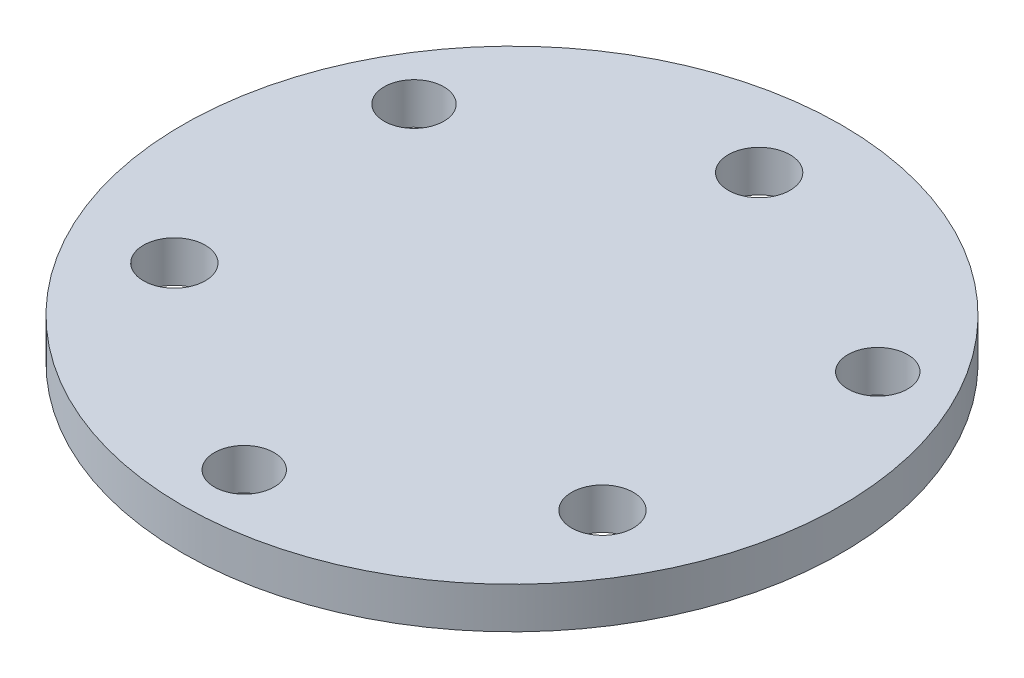
ISO-10303-21;
HEADER;
FILE_DESCRIPTION(('STEP AP214'),'2;1');
FILE_NAME('part.step','',(''),(''),'','','');
FILE_SCHEMA(('AUTOMOTIVE_DESIGN { 1 0 10303 214 1 1 1 1 }'));
ENDSEC;
DATA;
#1=APPLICATION_CONTEXT('core data for automotive mechanical design processes');
#2=APPLICATION_PROTOCOL_DEFINITION('international standard','automotive_design',2000,#1);
#3=PRODUCT_CONTEXT('',#1,'mechanical');
#4=PRODUCT('Part','Part','',(#3));
#5=PRODUCT_RELATED_PRODUCT_CATEGORY('part','',(#4));
#6=PRODUCT_DEFINITION_FORMATION('','',#4);
#7=PRODUCT_DEFINITION_CONTEXT('part definition',#1,'design');
#8=PRODUCT_DEFINITION('design','',#6,#7);
#9=PRODUCT_DEFINITION_SHAPE('','',#8);
#10=(LENGTH_UNIT() NAMED_UNIT(*) SI_UNIT(.MILLI.,.METRE.));
#11=(NAMED_UNIT(*) PLANE_ANGLE_UNIT() SI_UNIT($,.RADIAN.));
#12=(NAMED_UNIT(*) SI_UNIT($,.STERADIAN.) SOLID_ANGLE_UNIT());
#13=UNCERTAINTY_MEASURE_WITH_UNIT(LENGTH_MEASURE(1.E-05),#10,'distance_accuracy_value','');
#14=(GEOMETRIC_REPRESENTATION_CONTEXT(3) GLOBAL_UNCERTAINTY_ASSIGNED_CONTEXT((#13)) GLOBAL_UNIT_ASSIGNED_CONTEXT((#10,
#11,#12)) REPRESENTATION_CONTEXT('',''));
#15=CARTESIAN_POINT('',(0.,0.,0.));
#16=DIRECTION('',(0.,0.,1.));
#17=DIRECTION('',(1.,0.,0.));
#18=AXIS2_PLACEMENT_3D('',#15,#16,#17);
#19=CARTESIAN_POINT('',(0.,2.,0.));
#20=DIRECTION('',(0.,1.,0.));
#21=DIRECTION('',(0.,0.,1.));
#22=AXIS2_PLACEMENT_3D('',#19,#20,#21);
#23=PLANE('',#22);
#24=CARTESIAN_POINT('',(0.,2.,13.));
#25=DIRECTION('',(0.,1.,0.));
#26=DIRECTION('',(0.,0.,1.));
#27=AXIS2_PLACEMENT_3D('',#24,#25,#26);
#28=CIRCLE('',#27,1.45);
#29=CARTESIAN_POINT('',(0.,2.,14.45));
#30=VERTEX_POINT('',#29);
#31=EDGE_CURVE('E67',#30,#30,#28,.T.);
#32=ORIENTED_EDGE('',*,*,#31,.F.);
#33=EDGE_LOOP('',(#32));
#34=FACE_BOUND('',#33,.T.);
#35=CARTESIAN_POINT('',(10.3923048454133,2.,5.9999999999999));
#36=DIRECTION('',(0.,1.,0.));
#37=DIRECTION('',(0.,0.,1.));
#38=AXIS2_PLACEMENT_3D('',#35,#36,#37);
#39=CIRCLE('',#38,1.5);
#40=CARTESIAN_POINT('',(10.3923048454133,2.,7.4999999999999));
#41=VERTEX_POINT('',#40);
#42=EDGE_CURVE('E55',#41,#41,#39,.T.);
#43=ORIENTED_EDGE('',*,*,#42,.F.);
#44=EDGE_LOOP('',(#43));
#45=FACE_BOUND('',#44,.T.);
#46=CARTESIAN_POINT('',(0.,2.,-12.));
#47=DIRECTION('',(0.,1.,0.));
#48=DIRECTION('',(0.,0.,1.));
#49=AXIS2_PLACEMENT_3D('',#46,#47,#48);
#50=CIRCLE('',#49,1.5);
#51=CARTESIAN_POINT('',(0.,2.,-10.5));
#52=VERTEX_POINT('',#51);
#53=EDGE_CURVE('E44',#52,#52,#50,.T.);
#54=ORIENTED_EDGE('',*,*,#53,.F.);
#55=EDGE_LOOP('',(#54));
#56=FACE_BOUND('',#55,.T.);
#57=CARTESIAN_POINT('',(0.,2.,0.));
#58=DIRECTION('',(0.,1.,0.));
#59=DIRECTION('',(0.,0.,1.));
#60=AXIS2_PLACEMENT_3D('',#57,#58,#59);
#61=CIRCLE('',#60,16.);
#62=CARTESIAN_POINT('',(0.,2.,16.));
#63=VERTEX_POINT('',#62);
#64=EDGE_CURVE('E10',#63,#63,#61,.T.);
#65=ORIENTED_EDGE('',*,*,#64,.T.);
#66=EDGE_LOOP('',(#65));
#67=FACE_BOUND('',#66,.T.);
#68=CARTESIAN_POINT('',(-10.3923048454132,2.,6.00000000000005));
#69=DIRECTION('',(0.,1.,0.));
#70=DIRECTION('',(0.,0.,1.));
#71=AXIS2_PLACEMENT_3D('',#68,#69,#70);
#72=CIRCLE('',#71,1.5);
#73=CARTESIAN_POINT('',(-10.3923048454132,2.,7.50000000000005));
#74=VERTEX_POINT('',#73);
#75=EDGE_CURVE('E49',#74,#74,#72,.T.);
#76=ORIENTED_EDGE('',*,*,#75,.F.);
#77=EDGE_LOOP('',(#76));
#78=FACE_BOUND('',#77,.T.);
#79=CARTESIAN_POINT('',(-11.2583302491978,2.,-6.4999999999999));
#80=DIRECTION('',(0.,1.,0.));
#81=DIRECTION('',(0.,0.,1.));
#82=AXIS2_PLACEMENT_3D('',#79,#80,#81);
#83=CIRCLE('',#82,1.45);
#84=CARTESIAN_POINT('',(-11.2583302491978,2.,-5.0499999999999));
#85=VERTEX_POINT('',#84);
#86=EDGE_CURVE('E61',#85,#85,#83,.T.);
#87=ORIENTED_EDGE('',*,*,#86,.F.);
#88=EDGE_LOOP('',(#87));
#89=FACE_BOUND('',#88,.T.);
#90=CARTESIAN_POINT('',(11.2583302491977,2.,-6.50000000000005));
#91=DIRECTION('',(0.,1.,0.));
#92=DIRECTION('',(0.,0.,1.));
#93=AXIS2_PLACEMENT_3D('',#90,#91,#92);
#94=CIRCLE('',#93,1.45);
#95=CARTESIAN_POINT('',(11.2583302491977,2.,-5.05000000000005));
#96=VERTEX_POINT('',#95);
#97=EDGE_CURVE('E73',#96,#96,#94,.T.);
#98=ORIENTED_EDGE('',*,*,#97,.F.);
#99=EDGE_LOOP('',(#98));
#100=FACE_BOUND('',#99,.T.);
#101=ADVANCED_FACE('F33',(#34,#45,#56,#67,#78,#89,#100),#23,.T.);
#102=CARTESIAN_POINT('',(0.,0.,0.));
#103=DIRECTION('',(0.,1.,0.));
#104=DIRECTION('',(0.,0.,1.));
#105=AXIS2_PLACEMENT_3D('',#102,#103,#104);
#106=PLANE('',#105);
#107=CARTESIAN_POINT('',(0.,0.,0.));
#108=DIRECTION('',(0.,1.,0.));
#109=DIRECTION('',(0.,0.,1.));
#110=AXIS2_PLACEMENT_3D('',#107,#108,#109);
#111=CIRCLE('',#110,16.);
#112=CARTESIAN_POINT('',(0.,0.,16.));
#113=VERTEX_POINT('',#112);
#114=EDGE_CURVE('E37',#113,#113,#111,.T.);
#115=ORIENTED_EDGE('',*,*,#114,.F.);
#116=EDGE_LOOP('',(#115));
#117=FACE_BOUND('',#116,.T.);
#118=CARTESIAN_POINT('',(0.,0.,-12.));
#119=DIRECTION('',(0.,1.,0.));
#120=DIRECTION('',(0.,0.,1.));
#121=AXIS2_PLACEMENT_3D('',#118,#119,#120);
#122=CIRCLE('',#121,1.5);
#123=CARTESIAN_POINT('',(0.,0.,-10.5));
#124=VERTEX_POINT('',#123);
#125=EDGE_CURVE('E46',#124,#124,#122,.T.);
#126=ORIENTED_EDGE('',*,*,#125,.T.);
#127=EDGE_LOOP('',(#126));
#128=FACE_BOUND('',#127,.T.);
#129=CARTESIAN_POINT('',(-10.3923048454132,0.,6.00000000000005));
#130=DIRECTION('',(0.,1.,0.));
#131=DIRECTION('',(0.,0.,1.));
#132=AXIS2_PLACEMENT_3D('',#129,#130,#131);
#133=CIRCLE('',#132,1.5);
#134=CARTESIAN_POINT('',(-10.3923048454132,0.,7.50000000000005));
#135=VERTEX_POINT('',#134);
#136=EDGE_CURVE('E52',#135,#135,#133,.T.);
#137=ORIENTED_EDGE('',*,*,#136,.T.);
#138=EDGE_LOOP('',(#137));
#139=FACE_BOUND('',#138,.T.);
#140=CARTESIAN_POINT('',(10.3923048454133,0.,5.9999999999999));
#141=DIRECTION('',(0.,1.,0.));
#142=DIRECTION('',(0.,0.,1.));
#143=AXIS2_PLACEMENT_3D('',#140,#141,#142);
#144=CIRCLE('',#143,1.5);
#145=CARTESIAN_POINT('',(10.3923048454133,0.,7.4999999999999));
#146=VERTEX_POINT('',#145);
#147=EDGE_CURVE('E58',#146,#146,#144,.T.);
#148=ORIENTED_EDGE('',*,*,#147,.T.);
#149=EDGE_LOOP('',(#148));
#150=FACE_BOUND('',#149,.T.);
#151=CARTESIAN_POINT('',(-11.2583302491978,0.,-6.4999999999999));
#152=DIRECTION('',(0.,1.,0.));
#153=DIRECTION('',(0.,0.,1.));
#154=AXIS2_PLACEMENT_3D('',#151,#152,#153);
#155=CIRCLE('',#154,1.45);
#156=CARTESIAN_POINT('',(-11.2583302491978,0.,-5.0499999999999));
#157=VERTEX_POINT('',#156);
#158=EDGE_CURVE('E64',#157,#157,#155,.T.);
#159=ORIENTED_EDGE('',*,*,#158,.T.);
#160=EDGE_LOOP('',(#159));
#161=FACE_BOUND('',#160,.T.);
#162=CARTESIAN_POINT('',(0.,0.,13.));
#163=DIRECTION('',(0.,1.,0.));
#164=DIRECTION('',(0.,0.,1.));
#165=AXIS2_PLACEMENT_3D('',#162,#163,#164);
#166=CIRCLE('',#165,1.45);
#167=CARTESIAN_POINT('',(0.,0.,14.45));
#168=VERTEX_POINT('',#167);
#169=EDGE_CURVE('E70',#168,#168,#166,.T.);
#170=ORIENTED_EDGE('',*,*,#169,.T.);
#171=EDGE_LOOP('',(#170));
#172=FACE_BOUND('',#171,.T.);
#173=CARTESIAN_POINT('',(11.2583302491977,0.,-6.50000000000005));
#174=DIRECTION('',(0.,1.,0.));
#175=DIRECTION('',(0.,0.,1.));
#176=AXIS2_PLACEMENT_3D('',#173,#174,#175);
#177=CIRCLE('',#176,1.45);
#178=CARTESIAN_POINT('',(11.2583302491977,0.,-5.05000000000005));
#179=VERTEX_POINT('',#178);
#180=EDGE_CURVE('E76',#179,#179,#177,.T.);
#181=ORIENTED_EDGE('',*,*,#180,.T.);
#182=EDGE_LOOP('',(#181));
#183=FACE_BOUND('',#182,.T.);
#184=ADVANCED_FACE('F86',(#117,#128,#139,#150,#161,#172,#183),#106,.F.);
#185=CARTESIAN_POINT('',(0.,2.,0.));
#186=DIRECTION('',(0.,-1.,0.));
#187=DIRECTION('',(0.,0.,-1.));
#188=AXIS2_PLACEMENT_3D('',#185,#186,#187);
#189=CYLINDRICAL_SURFACE('',#188,16.);
#190=ORIENTED_EDGE('',*,*,#64,.F.);
#191=EDGE_LOOP('',(#190));
#192=FACE_BOUND('',#191,.T.);
#193=ORIENTED_EDGE('',*,*,#114,.T.);
#194=EDGE_LOOP('',(#193));
#195=FACE_BOUND('',#194,.T.);
#196=ADVANCED_FACE('F35',(#192,#195),#189,.T.);
#197=CARTESIAN_POINT('',(0.,2.,-12.));
#198=DIRECTION('',(0.,-1.,0.));
#199=DIRECTION('',(0.,0.,-1.));
#200=AXIS2_PLACEMENT_3D('',#197,#198,#199);
#201=CYLINDRICAL_SURFACE('',#200,1.5);
#202=ORIENTED_EDGE('',*,*,#53,.T.);
#203=EDGE_LOOP('',(#202));
#204=FACE_BOUND('',#203,.T.);
#205=ORIENTED_EDGE('',*,*,#125,.F.);
#206=EDGE_LOOP('',(#205));
#207=FACE_BOUND('',#206,.T.);
#208=ADVANCED_FACE('F96',(#204,#207),#201,.F.);
#209=CARTESIAN_POINT('',(-10.3923048454132,2.,6.00000000000005));
#210=DIRECTION('',(0.,-1.,0.));
#211=DIRECTION('',(0.,0.,-1.));
#212=AXIS2_PLACEMENT_3D('',#209,#210,#211);
#213=CYLINDRICAL_SURFACE('',#212,1.5);
#214=ORIENTED_EDGE('',*,*,#75,.T.);
#215=EDGE_LOOP('',(#214));
#216=FACE_BOUND('',#215,.T.);
#217=ORIENTED_EDGE('',*,*,#136,.F.);
#218=EDGE_LOOP('',(#217));
#219=FACE_BOUND('',#218,.T.);
#220=ADVANCED_FACE('F99',(#216,#219),#213,.F.);
#221=CARTESIAN_POINT('',(10.3923048454133,2.,5.9999999999999));
#222=DIRECTION('',(0.,-1.,0.));
#223=DIRECTION('',(0.,0.,-1.));
#224=AXIS2_PLACEMENT_3D('',#221,#222,#223);
#225=CYLINDRICAL_SURFACE('',#224,1.5);
#226=ORIENTED_EDGE('',*,*,#42,.T.);
#227=EDGE_LOOP('',(#226));
#228=FACE_BOUND('',#227,.T.);
#229=ORIENTED_EDGE('',*,*,#147,.F.);
#230=EDGE_LOOP('',(#229));
#231=FACE_BOUND('',#230,.T.);
#232=ADVANCED_FACE('F103',(#228,#231),#225,.F.);
#233=CARTESIAN_POINT('',(-11.2583302491978,2.,-6.4999999999999));
#234=DIRECTION('',(0.,-1.,0.));
#235=DIRECTION('',(0.,0.,-1.));
#236=AXIS2_PLACEMENT_3D('',#233,#234,#235);
#237=CYLINDRICAL_SURFACE('',#236,1.45);
#238=ORIENTED_EDGE('',*,*,#86,.T.);
#239=EDGE_LOOP('',(#238));
#240=FACE_BOUND('',#239,.T.);
#241=ORIENTED_EDGE('',*,*,#158,.F.);
#242=EDGE_LOOP('',(#241));
#243=FACE_BOUND('',#242,.T.);
#244=ADVANCED_FACE('F107',(#240,#243),#237,.F.);
#245=CARTESIAN_POINT('',(0.,2.,13.));
#246=DIRECTION('',(0.,-1.,0.));
#247=DIRECTION('',(0.,0.,-1.));
#248=AXIS2_PLACEMENT_3D('',#245,#246,#247);
#249=CYLINDRICAL_SURFACE('',#248,1.45);
#250=ORIENTED_EDGE('',*,*,#31,.T.);
#251=EDGE_LOOP('',(#250));
#252=FACE_BOUND('',#251,.T.);
#253=ORIENTED_EDGE('',*,*,#169,.F.);
#254=EDGE_LOOP('',(#253));
#255=FACE_BOUND('',#254,.T.);
#256=ADVANCED_FACE('F111',(#252,#255),#249,.F.);
#257=CARTESIAN_POINT('',(11.2583302491977,2.,-6.50000000000005));
#258=DIRECTION('',(0.,-1.,0.));
#259=DIRECTION('',(0.,0.,-1.));
#260=AXIS2_PLACEMENT_3D('',#257,#258,#259);
#261=CYLINDRICAL_SURFACE('',#260,1.45);
#262=ORIENTED_EDGE('',*,*,#97,.T.);
#263=EDGE_LOOP('',(#262));
#264=FACE_BOUND('',#263,.T.);
#265=ORIENTED_EDGE('',*,*,#180,.F.);
#266=EDGE_LOOP('',(#265));
#267=FACE_BOUND('',#266,.T.);
#268=ADVANCED_FACE('F82',(#264,#267),#261,.F.);
#269=CLOSED_SHELL('',(#101,#184,#196,#208,#220,#232,#244,#256,#268));
#270=MANIFOLD_SOLID_BREP('B2',#269);
#271=ADVANCED_BREP_SHAPE_REPRESENTATION('',(#18,#270),#14);
#272=SHAPE_DEFINITION_REPRESENTATION(#9,#271);
ENDSEC;
END-ISO-10303-21;
